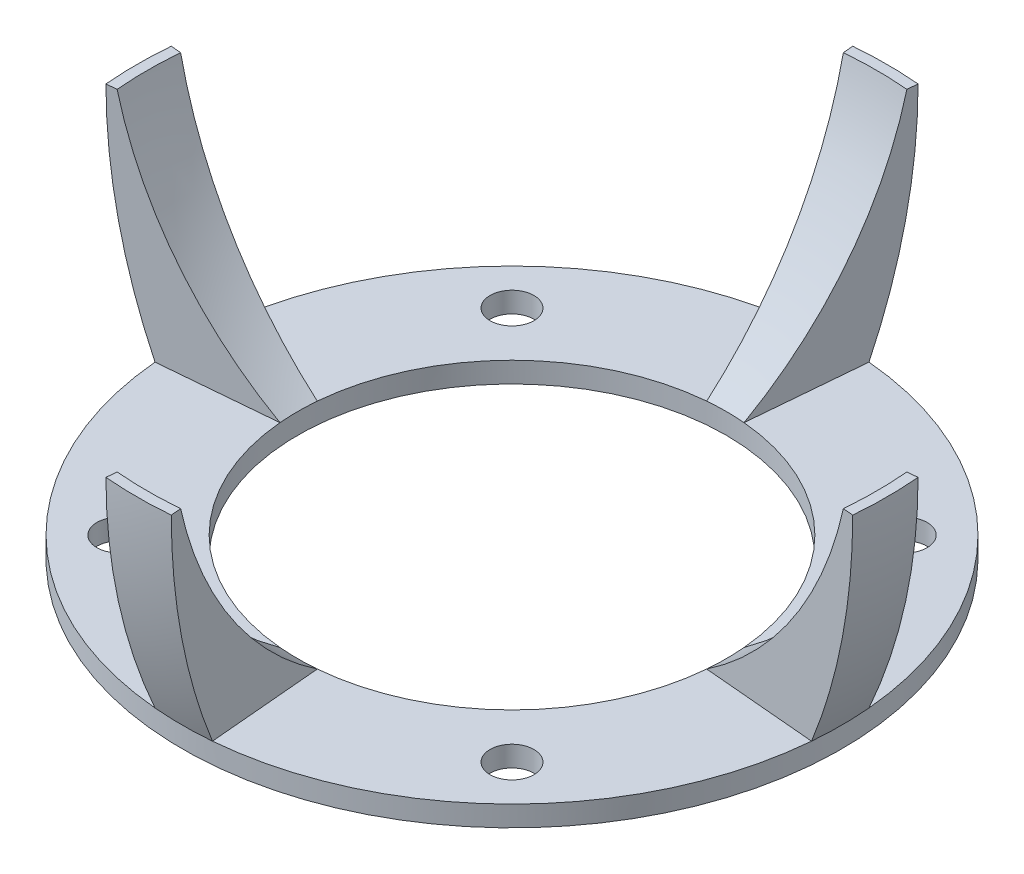
ISO-10303-21;
HEADER;
FILE_DESCRIPTION(('STEP AP214'),'2;1');
FILE_NAME('part.step','',(''),(''),'','','');
FILE_SCHEMA(('AUTOMOTIVE_DESIGN { 1 0 10303 214 1 1 1 1 }'));
ENDSEC;
DATA;
#1=APPLICATION_CONTEXT('core data for automotive mechanical design processes');
#2=APPLICATION_PROTOCOL_DEFINITION('international standard','automotive_design',2000,#1);
#3=PRODUCT_CONTEXT('',#1,'mechanical');
#4=PRODUCT('Part','Part','',(#3));
#5=PRODUCT_RELATED_PRODUCT_CATEGORY('part','',(#4));
#6=PRODUCT_DEFINITION_FORMATION('','',#4);
#7=PRODUCT_DEFINITION_CONTEXT('part definition',#1,'design');
#8=PRODUCT_DEFINITION('design','',#6,#7);
#9=PRODUCT_DEFINITION_SHAPE('','',#8);
#10=(LENGTH_UNIT() NAMED_UNIT(*) SI_UNIT(.MILLI.,.METRE.));
#11=(NAMED_UNIT(*) PLANE_ANGLE_UNIT() SI_UNIT($,.RADIAN.));
#12=(NAMED_UNIT(*) SI_UNIT($,.STERADIAN.) SOLID_ANGLE_UNIT());
#13=UNCERTAINTY_MEASURE_WITH_UNIT(LENGTH_MEASURE(1.E-05),#10,'distance_accuracy_value','');
#14=(GEOMETRIC_REPRESENTATION_CONTEXT(3) GLOBAL_UNCERTAINTY_ASSIGNED_CONTEXT((#13)) GLOBAL_UNIT_ASSIGNED_CONTEXT((#10,
#11,#12)) REPRESENTATION_CONTEXT('',''));
#15=CARTESIAN_POINT('',(0.,0.,0.));
#16=DIRECTION('',(0.,0.,1.));
#17=DIRECTION('',(1.,0.,0.));
#18=AXIS2_PLACEMENT_3D('',#15,#16,#17);
#19=CARTESIAN_POINT('',(-50.8,3.175,0.));
#20=DIRECTION('',(0.,-1.,0.));
#21=DIRECTION('',(0.,0.,-1.));
#22=AXIS2_PLACEMENT_3D('',#19,#20,#21);
#23=PLANE('',#22);
#24=CARTESIAN_POINT('',(-30.3083644086088,3.175,-30.308364408608));
#25=DIRECTION('',(0.,1.,0.));
#26=DIRECTION('',(-1.,0.,0.));
#27=AXIS2_PLACEMENT_3D('',#24,#25,#26);
#28=CIRCLE('',#27,3.3782);
#29=CARTESIAN_POINT('',(-33.6865644086088,3.175,-30.308364408608));
#30=VERTEX_POINT('',#29);
#31=EDGE_CURVE('E409',#30,#30,#28,.T.);
#32=ORIENTED_EDGE('',*,*,#31,.F.);
#33=EDGE_LOOP('',(#32));
#34=FACE_BOUND('',#33,.T.);
#35=DIRECTION('',(0.0871557427476688,0.,0.996194698091745));
#36=VECTOR('',#35,1.);
#37=CARTESIAN_POINT('',(-2.87788262552802,3.175,-32.8943489309894));
#38=LINE('',#37,#36);
#39=CARTESIAN_POINT('',(-4.42751173158157,3.175,-50.6066906630606));
#40=VERTEX_POINT('',#39);
#41=CARTESIAN_POINT('',(-2.87788262552802,3.175,-32.8943489309894));
#42=VERTEX_POINT('',#41);
#43=EDGE_CURVE('E310',#40,#42,#38,.T.);
#44=ORIENTED_EDGE('',*,*,#43,.F.);
#45=CARTESIAN_POINT('',(0.,3.175,0.));
#46=DIRECTION('',(0.,-1.,0.));
#47=DIRECTION('',(0.,0.,-1.));
#48=AXIS2_PLACEMENT_3D('',#45,#46,#47);
#49=CIRCLE('',#48,50.8);
#50=CARTESIAN_POINT('',(-50.6066906630607,3.175,-4.42751173158104));
#51=VERTEX_POINT('',#50);
#52=EDGE_CURVE('E204',#51,#40,#49,.T.);
#53=ORIENTED_EDGE('',*,*,#52,.F.);
#54=DIRECTION('',(0.996194698091746,0.,0.0871557427476584));
#55=VECTOR('',#54,1.);
#56=CARTESIAN_POINT('',(-32.8943489309894,3.175,-2.87788262552768));
#57=LINE('',#56,#55);
#58=CARTESIAN_POINT('',(-32.8943489309894,3.175,-2.87788262552768));
#59=VERTEX_POINT('',#58);
#60=EDGE_CURVE('E273',#51,#59,#57,.T.);
#61=ORIENTED_EDGE('',*,*,#60,.T.);
#62=CARTESIAN_POINT('',(0.,3.175,0.));
#63=DIRECTION('',(0.,-1.,0.));
#64=DIRECTION('',(0.,0.,-1.));
#65=AXIS2_PLACEMENT_3D('',#62,#63,#64);
#66=CIRCLE('',#65,33.02);
#67=EDGE_CURVE('E190',#59,#42,#66,.T.);
#68=ORIENTED_EDGE('',*,*,#67,.T.);
#69=EDGE_LOOP('',(#44,#53,#61,#68));
#70=FACE_BOUND('',#69,.T.);
#71=ADVANCED_FACE('F36',(#34,#70),#23,.F.);
#72=CARTESIAN_POINT('',(30.3083644086083,3.175,-30.3083644086085));
#73=DIRECTION('',(0.,1.,0.));
#74=DIRECTION('',(0.,0.,-1.));
#75=AXIS2_PLACEMENT_3D('',#72,#73,#74);
#76=CIRCLE('',#75,3.3782);
#77=CARTESIAN_POINT('',(30.3083644086083,3.175,-33.6865644086085));
#78=VERTEX_POINT('',#77);
#79=EDGE_CURVE('E403',#78,#78,#76,.T.);
#80=ORIENTED_EDGE('',*,*,#79,.F.);
#81=EDGE_LOOP('',(#80));
#82=FACE_BOUND('',#81,.T.);
#83=CARTESIAN_POINT('',(4.42751173158051,3.175,-50.6066906630607));
#84=VERTEX_POINT('',#83);
#85=CARTESIAN_POINT('',(50.6066906630607,3.175,-4.42751173158104));
#86=VERTEX_POINT('',#85);
#87=EDGE_CURVE('E180',#84,#86,#49,.T.);
#88=ORIENTED_EDGE('',*,*,#87,.F.);
#89=DIRECTION('',(-0.0871557427476479,0.,0.996194698091746));
#90=VECTOR('',#89,1.);
#91=CARTESIAN_POINT('',(2.87788262552734,3.175,-32.8943489309895));
#92=LINE('',#91,#90);
#93=CARTESIAN_POINT('',(2.87788262552734,3.175,-32.8943489309895));
#94=VERTEX_POINT('',#93);
#95=EDGE_CURVE('E154',#84,#94,#92,.T.);
#96=ORIENTED_EDGE('',*,*,#95,.T.);
#97=CARTESIAN_POINT('',(32.8943489309894,3.175,-2.87788262552768));
#98=VERTEX_POINT('',#97);
#99=EDGE_CURVE('E178',#94,#98,#66,.T.);
#100=ORIENTED_EDGE('',*,*,#99,.T.);
#101=DIRECTION('',(-0.996194698091746,0.,0.0871557427476583));
#102=VECTOR('',#101,1.);
#103=CARTESIAN_POINT('',(32.8943489309894,3.175,-2.87788262552768));
#104=LINE('',#103,#102);
#105=EDGE_CURVE('E222',#86,#98,#104,.T.);
#106=ORIENTED_EDGE('',*,*,#105,.F.);
#107=EDGE_LOOP('',(#88,#96,#100,#106));
#108=FACE_BOUND('',#107,.T.);
#109=ADVANCED_FACE('F176',(#82,#108),#23,.F.);
#110=CARTESIAN_POINT('',(30.3083644086086,3.175,30.3083644086082));
#111=DIRECTION('',(0.,1.,0.));
#112=DIRECTION('',(1.,0.,0.));
#113=AXIS2_PLACEMENT_3D('',#110,#111,#112);
#114=CIRCLE('',#113,3.3782);
#115=CARTESIAN_POINT('',(33.6865644086086,3.175,30.3083644086082));
#116=VERTEX_POINT('',#115);
#117=EDGE_CURVE('E395',#116,#116,#114,.T.);
#118=ORIENTED_EDGE('',*,*,#117,.F.);
#119=EDGE_LOOP('',(#118));
#120=FACE_BOUND('',#119,.T.);
#121=CARTESIAN_POINT('',(50.6066906630607,3.175,4.42751173158104));
#122=VERTEX_POINT('',#121);
#123=CARTESIAN_POINT('',(4.42751173158122,3.175,50.6066906630607));
#124=VERTEX_POINT('',#123);
#125=EDGE_CURVE('E203',#122,#124,#49,.T.);
#126=ORIENTED_EDGE('',*,*,#125,.F.);
#127=DIRECTION('',(-0.996194698091746,0.,-0.0871557427476584));
#128=VECTOR('',#127,1.);
#129=CARTESIAN_POINT('',(32.8943489309894,3.175,2.87788262552768));
#130=LINE('',#129,#128);
#131=CARTESIAN_POINT('',(32.8943489309894,3.175,2.87788262552768));
#132=VERTEX_POINT('',#131);
#133=EDGE_CURVE('E172',#122,#132,#130,.T.);
#134=ORIENTED_EDGE('',*,*,#133,.T.);
#135=CARTESIAN_POINT('',(2.87788262552779,3.175,32.8943489309894));
#136=VERTEX_POINT('',#135);
#137=EDGE_CURVE('E191',#132,#136,#66,.T.);
#138=ORIENTED_EDGE('',*,*,#137,.T.);
#139=DIRECTION('',(-0.0871557427476618,0.,-0.996194698091745));
#140=VECTOR('',#139,1.);
#141=CARTESIAN_POINT('',(2.87788262552779,3.175,32.8943489309894));
#142=LINE('',#141,#140);
#143=EDGE_CURVE('E258',#124,#136,#142,.T.);
#144=ORIENTED_EDGE('',*,*,#143,.F.);
#145=EDGE_LOOP('',(#126,#134,#138,#144));
#146=FACE_BOUND('',#145,.T.);
#147=ADVANCED_FACE('F342',(#120,#146),#23,.F.);
#148=CARTESIAN_POINT('',(0.,-0.158750000000002,0.));
#149=DIRECTION('',(0.,-1.,0.));
#150=DIRECTION('',(0.,0.,-1.));
#151=AXIS2_PLACEMENT_3D('',#148,#149,#150);
#152=CYLINDRICAL_SURFACE('',#151,33.02);
#153=CARTESIAN_POINT('',(-32.8943489309894,3.175,2.87788262552768));
#154=VERTEX_POINT('',#153);
#155=EDGE_CURVE('E193',#154,#59,#66,.T.);
#156=ORIENTED_EDGE('',*,*,#155,.F.);
#157=CARTESIAN_POINT('',(-2.87788262552758,3.175,32.8943489309895));
#158=VERTEX_POINT('',#157);
#159=EDGE_CURVE('E194',#158,#154,#66,.T.);
#160=ORIENTED_EDGE('',*,*,#159,.F.);
#161=CARTESIAN_POINT('',(0.,3.175,0.));
#162=DIRECTION('',(0.,-1.,0.));
#163=DIRECTION('',(-1.,0.,0.));
#164=AXIS2_PLACEMENT_3D('',#161,#162,#163);
#165=CIRCLE('',#164,33.02);
#166=EDGE_CURVE('E263',#136,#158,#165,.T.);
#167=ORIENTED_EDGE('',*,*,#166,.F.);
#168=ORIENTED_EDGE('',*,*,#137,.F.);
#169=CARTESIAN_POINT('',(0.,3.175,0.));
#170=DIRECTION('',(0.,-1.,0.));
#171=DIRECTION('',(0.,0.,1.));
#172=AXIS2_PLACEMENT_3D('',#169,#170,#171);
#173=CIRCLE('',#172,33.02);
#174=EDGE_CURVE('E189',#98,#132,#173,.T.);
#175=ORIENTED_EDGE('',*,*,#174,.F.);
#176=ORIENTED_EDGE('',*,*,#99,.F.);
#177=CARTESIAN_POINT('',(0.,3.175,0.));
#178=DIRECTION('',(0.,-1.,0.));
#179=DIRECTION('',(1.,0.,0.));
#180=AXIS2_PLACEMENT_3D('',#177,#178,#179);
#181=CIRCLE('',#180,33.02);
#182=EDGE_CURVE('E163',#42,#94,#181,.T.);
#183=ORIENTED_EDGE('',*,*,#182,.F.);
#184=ORIENTED_EDGE('',*,*,#67,.F.);
#185=EDGE_LOOP('',(#156,#160,#167,#168,#175,#176,#183,#184));
#186=FACE_BOUND('',#185,.T.);
#187=CARTESIAN_POINT('',(0.,0.,0.));
#188=DIRECTION('',(0.,-1.,0.));
#189=DIRECTION('',(0.,0.,-1.));
#190=AXIS2_PLACEMENT_3D('',#187,#188,#189);
#191=CIRCLE('',#190,33.02);
#192=CARTESIAN_POINT('',(0.,0.,-33.02));
#193=VERTEX_POINT('',#192);
#194=EDGE_CURVE('E11',#193,#193,#191,.T.);
#195=ORIENTED_EDGE('',*,*,#194,.T.);
#196=EDGE_LOOP('',(#195));
#197=FACE_BOUND('',#196,.T.);
#198=ADVANCED_FACE('F38',(#186,#197),#152,.F.);
#199=CARTESIAN_POINT('',(-33.02,0.,0.));
#200=DIRECTION('',(0.,1.,0.));
#201=DIRECTION('',(0.,0.,1.));
#202=AXIS2_PLACEMENT_3D('',#199,#200,#201);
#203=PLANE('',#202);
#204=CARTESIAN_POINT('',(30.3083644086086,0.,30.3083644086082));
#205=DIRECTION('',(0.,1.,0.));
#206=DIRECTION('',(1.,0.,0.));
#207=AXIS2_PLACEMENT_3D('',#204,#205,#206);
#208=CIRCLE('',#207,3.3782);
#209=CARTESIAN_POINT('',(33.6865644086086,0.,30.3083644086082));
#210=VERTEX_POINT('',#209);
#211=EDGE_CURVE('E398',#210,#210,#208,.T.);
#212=ORIENTED_EDGE('',*,*,#211,.T.);
#213=EDGE_LOOP('',(#212));
#214=FACE_BOUND('',#213,.T.);
#215=CARTESIAN_POINT('',(30.3083644086083,0.,-30.3083644086085));
#216=DIRECTION('',(0.,1.,0.));
#217=DIRECTION('',(0.,0.,-1.));
#218=AXIS2_PLACEMENT_3D('',#215,#216,#217);
#219=CIRCLE('',#218,3.3782);
#220=CARTESIAN_POINT('',(30.3083644086083,0.,-33.6865644086085));
#221=VERTEX_POINT('',#220);
#222=EDGE_CURVE('E406',#221,#221,#219,.T.);
#223=ORIENTED_EDGE('',*,*,#222,.T.);
#224=EDGE_LOOP('',(#223));
#225=FACE_BOUND('',#224,.T.);
#226=CARTESIAN_POINT('',(-30.3083644086088,0.,-30.308364408608));
#227=DIRECTION('',(0.,1.,0.));
#228=DIRECTION('',(-1.,0.,0.));
#229=AXIS2_PLACEMENT_3D('',#226,#227,#228);
#230=CIRCLE('',#229,3.3782);
#231=CARTESIAN_POINT('',(-33.6865644086088,0.,-30.308364408608));
#232=VERTEX_POINT('',#231);
#233=EDGE_CURVE('E412',#232,#232,#230,.T.);
#234=ORIENTED_EDGE('',*,*,#233,.T.);
#235=EDGE_LOOP('',(#234));
#236=FACE_BOUND('',#235,.T.);
#237=CARTESIAN_POINT('',(-30.3083644086083,0.,30.3083644086085));
#238=DIRECTION('',(0.,1.,0.));
#239=DIRECTION('',(0.,0.,1.));
#240=AXIS2_PLACEMENT_3D('',#237,#238,#239);
#241=CIRCLE('',#240,3.3782);
#242=CARTESIAN_POINT('',(-30.3083644086083,0.,33.6865644086085));
#243=VERTEX_POINT('',#242);
#244=EDGE_CURVE('E182',#243,#243,#241,.T.);
#245=ORIENTED_EDGE('',*,*,#244,.T.);
#246=EDGE_LOOP('',(#245));
#247=FACE_BOUND('',#246,.T.);
#248=ORIENTED_EDGE('',*,*,#194,.F.);
#249=EDGE_LOOP('',(#248));
#250=FACE_BOUND('',#249,.T.);
#251=CARTESIAN_POINT('',(0.,0.,0.));
#252=DIRECTION('',(0.,-1.,0.));
#253=DIRECTION('',(0.,0.,-1.));
#254=AXIS2_PLACEMENT_3D('',#251,#252,#253);
#255=CIRCLE('',#254,50.8);
#256=CARTESIAN_POINT('',(0.,0.,-50.8));
#257=VERTEX_POINT('',#256);
#258=EDGE_CURVE('E44',#257,#257,#255,.T.);
#259=ORIENTED_EDGE('',*,*,#258,.T.);
#260=EDGE_LOOP('',(#259));
#261=FACE_BOUND('',#260,.T.);
#262=ADVANCED_FACE('F385',(#214,#225,#236,#247,#250,#261),#203,.F.);
#263=CARTESIAN_POINT('',(0.,-0.158750000000002,0.));
#264=DIRECTION('',(0.,-1.,0.));
#265=DIRECTION('',(0.,0.,-1.));
#266=AXIS2_PLACEMENT_3D('',#263,#264,#265);
#267=CYLINDRICAL_SURFACE('',#266,50.8);
#268=ORIENTED_EDGE('',*,*,#258,.F.);
#269=EDGE_LOOP('',(#268));
#270=FACE_BOUND('',#269,.T.);
#271=CARTESIAN_POINT('',(-50.6066906630607,3.175,4.42751173158104));
#272=VERTEX_POINT('',#271);
#273=EDGE_CURVE('E210',#272,#51,#49,.T.);
#274=ORIENTED_EDGE('',*,*,#273,.T.);
#275=ORIENTED_EDGE('',*,*,#52,.T.);
#276=CARTESIAN_POINT('',(0.,3.175,0.));
#277=DIRECTION('',(0.,-1.,0.));
#278=DIRECTION('',(1.,0.,0.));
#279=AXIS2_PLACEMENT_3D('',#276,#277,#278);
#280=CIRCLE('',#279,50.8);
#281=EDGE_CURVE('E173',#40,#84,#280,.T.);
#282=ORIENTED_EDGE('',*,*,#281,.T.);
#283=ORIENTED_EDGE('',*,*,#87,.T.);
#284=CARTESIAN_POINT('',(0.,3.175,0.));
#285=DIRECTION('',(0.,-1.,0.));
#286=DIRECTION('',(0.,0.,1.));
#287=AXIS2_PLACEMENT_3D('',#284,#285,#286);
#288=CIRCLE('',#287,50.8);
#289=EDGE_CURVE('E215',#86,#122,#288,.T.);
#290=ORIENTED_EDGE('',*,*,#289,.T.);
#291=ORIENTED_EDGE('',*,*,#125,.T.);
#292=CARTESIAN_POINT('',(0.,3.175,0.));
#293=DIRECTION('',(0.,-1.,0.));
#294=DIRECTION('',(-1.,0.,0.));
#295=AXIS2_PLACEMENT_3D('',#292,#293,#294);
#296=CIRCLE('',#295,50.8);
#297=CARTESIAN_POINT('',(-4.42751173158087,3.175,50.6066906630607));
#298=VERTEX_POINT('',#297);
#299=EDGE_CURVE('E261',#124,#298,#296,.T.);
#300=ORIENTED_EDGE('',*,*,#299,.T.);
#301=EDGE_CURVE('E198',#298,#272,#49,.T.);
#302=ORIENTED_EDGE('',*,*,#301,.T.);
#303=EDGE_LOOP('',(#274,#275,#282,#283,#290,#291,#300,#302));
#304=FACE_BOUND('',#303,.T.);
#305=ADVANCED_FACE('F214',(#270,#304),#267,.T.);
#306=CARTESIAN_POINT('',(-30.3083644086083,3.175,30.3083644086085));
#307=DIRECTION('',(0.,1.,0.));
#308=DIRECTION('',(0.,0.,1.));
#309=AXIS2_PLACEMENT_3D('',#306,#307,#308);
#310=CIRCLE('',#309,3.3782);
#311=CARTESIAN_POINT('',(-30.3083644086083,3.175,33.6865644086085));
#312=VERTEX_POINT('',#311);
#313=EDGE_CURVE('E397',#312,#312,#310,.T.);
#314=ORIENTED_EDGE('',*,*,#313,.F.);
#315=EDGE_LOOP('',(#314));
#316=FACE_BOUND('',#315,.T.);
#317=ORIENTED_EDGE('',*,*,#301,.F.);
#318=DIRECTION('',(0.0871557427476549,0.,-0.996194698091746));
#319=VECTOR('',#318,1.);
#320=CARTESIAN_POINT('',(-2.87788262552756,3.175,32.8943489309895));
#321=LINE('',#320,#319);
#322=EDGE_CURVE('E233',#298,#158,#321,.T.);
#323=ORIENTED_EDGE('',*,*,#322,.T.);
#324=ORIENTED_EDGE('',*,*,#159,.T.);
#325=DIRECTION('',(0.996194698091746,0.,-0.0871557427476583));
#326=VECTOR('',#325,1.);
#327=CARTESIAN_POINT('',(-32.8943489309894,3.175,2.87788262552768));
#328=LINE('',#327,#326);
#329=EDGE_CURVE('E284',#272,#154,#328,.T.);
#330=ORIENTED_EDGE('',*,*,#329,.F.);
#331=EDGE_LOOP('',(#317,#323,#324,#330));
#332=FACE_BOUND('',#331,.T.);
#333=ADVANCED_FACE('F293',(#316,#332),#23,.F.);
#334=CARTESIAN_POINT('',(0.,50.5963646471714,0.));
#335=DIRECTION('',(0.,-1.,0.));
#336=DIRECTION('',(-0.996194698091746,0.,0.0871557427476583));
#337=AXIS2_PLACEMENT_3D('',#334,#335,#336);
#338=SPHERICAL_SURFACE('',#337,57.785);
#339=ORIENTED_EDGE('',*,*,#155,.T.);
#340=CARTESIAN_POINT('',(0.,50.5963646471714,0.));
#341=DIRECTION('',(0.0871557427476584,0.,-0.996194698091746));
#342=DIRECTION('',(-0.996194698091746,0.,-0.0871557427476584));
#343=AXIS2_PLACEMENT_3D('',#340,#341,#342);
#344=CIRCLE('',#343,57.785);
#345=CARTESIAN_POINT('',(-55.9836515460109,37.1447023428315,-4.89793485306153));
#346=VERTEX_POINT('',#345);
#347=EDGE_CURVE('E265',#59,#346,#344,.T.);
#348=ORIENTED_EDGE('',*,*,#347,.T.);
#349=CARTESIAN_POINT('',(0.,37.1447023428315,0.));
#350=DIRECTION('',(0.,-1.,0.));
#351=DIRECTION('',(0.,0.,-1.));
#352=AXIS2_PLACEMENT_3D('',#349,#350,#351);
#353=CIRCLE('',#352,56.1975);
#354=CARTESIAN_POINT('',(-55.9836515460109,37.1447023428315,4.89793485306153));
#355=VERTEX_POINT('',#354);
#356=EDGE_CURVE('E287',#355,#346,#353,.T.);
#357=ORIENTED_EDGE('',*,*,#356,.F.);
#358=CARTESIAN_POINT('',(0.,50.5963646471714,0.));
#359=DIRECTION('',(-0.0871557427476583,0.,-0.996194698091746));
#360=DIRECTION('',(-0.996194698091746,0.,0.0871557427476583));
#361=AXIS2_PLACEMENT_3D('',#358,#359,#360);
#362=CIRCLE('',#361,57.785);
#363=EDGE_CURVE('E275',#154,#355,#362,.T.);
#364=ORIENTED_EDGE('',*,*,#363,.F.);
#365=EDGE_LOOP('',(#339,#348,#357,#364));
#366=FACE_BOUND('',#365,.T.);
#367=ADVANCED_FACE('F298',(#366),#338,.F.);
#368=CARTESIAN_POINT('',(0.,37.1447023428315,0.));
#369=DIRECTION('',(0.,-1.,0.));
#370=DIRECTION('',(0.,0.,-1.));
#371=AXIS2_PLACEMENT_3D('',#368,#369,#370);
#372=DEGENERATE_TOROIDAL_SURFACE('',#371,28.3088369549442,86.0938369549442,.F.);
#373=CARTESIAN_POINT('',(0.,37.1447023428315,0.));
#374=DIRECTION('',(0.,-1.,0.));
#375=DIRECTION('',(0.,0.,-1.));
#376=AXIS2_PLACEMENT_3D('',#373,#374,#375);
#377=CIRCLE('',#376,57.785);
#378=CARTESIAN_POINT('',(-57.5651106292315,37.1447023428315,5.03629459467344));
#379=VERTEX_POINT('',#378);
#380=CARTESIAN_POINT('',(-57.5651106292315,37.1447023428315,-5.03629459467344));
#381=VERTEX_POINT('',#380);
#382=EDGE_CURVE('E288',#379,#381,#377,.T.);
#383=ORIENTED_EDGE('',*,*,#382,.T.);
#384=CARTESIAN_POINT('',(28.2011132836591,37.1447023428315,2.46727771113052));
#385=DIRECTION('',(-0.0871557427476584,0.,0.996194698091746));
#386=DIRECTION('',(-0.996194698091746,0.,-0.0871557427476584));
#387=AXIS2_PLACEMENT_3D('',#384,#385,#386);
#388=CIRCLE('',#387,86.0938369549442);
#389=EDGE_CURVE('E270',#381,#51,#388,.T.);
#390=ORIENTED_EDGE('',*,*,#389,.T.);
#391=ORIENTED_EDGE('',*,*,#273,.F.);
#392=CARTESIAN_POINT('',(28.2011132836591,37.1447023428315,-2.46727771113052));
#393=DIRECTION('',(0.0871557427476583,0.,0.996194698091746));
#394=DIRECTION('',(-0.996194698091746,0.,0.0871557427476583));
#395=AXIS2_PLACEMENT_3D('',#392,#393,#394);
#396=CIRCLE('',#395,86.0938369549442);
#397=EDGE_CURVE('E281',#379,#272,#396,.T.);
#398=ORIENTED_EDGE('',*,*,#397,.F.);
#399=EDGE_LOOP('',(#383,#390,#391,#398));
#400=FACE_BOUND('',#399,.T.);
#401=ADVANCED_FACE('F303',(#400),#372,.F.);
#402=CARTESIAN_POINT('',(-55.9836515460109,37.1447023428315,4.89793485306153));
#403=DIRECTION('',(0.,-1.,0.));
#404=DIRECTION('',(0.,0.,-1.));
#405=AXIS2_PLACEMENT_3D('',#402,#403,#404);
#406=PLANE('',#405);
#407=DIRECTION('',(-0.996194698091746,0.,0.0871557427476583));
#408=VECTOR('',#407,1.);
#409=CARTESIAN_POINT('',(-55.9836515460109,37.1447023428315,4.89793485306153));
#410=LINE('',#409,#408);
#411=EDGE_CURVE('E278',#355,#379,#410,.T.);
#412=ORIENTED_EDGE('',*,*,#411,.F.);
#413=ORIENTED_EDGE('',*,*,#356,.T.);
#414=DIRECTION('',(-0.996194698091746,0.,-0.0871557427476584));
#415=VECTOR('',#414,1.);
#416=CARTESIAN_POINT('',(-55.9836515460109,37.1447023428315,-4.89793485306153));
#417=LINE('',#416,#415);
#418=EDGE_CURVE('E267',#346,#381,#417,.T.);
#419=ORIENTED_EDGE('',*,*,#418,.T.);
#420=ORIENTED_EDGE('',*,*,#382,.F.);
#421=EDGE_LOOP('',(#412,#413,#419,#420));
#422=FACE_BOUND('',#421,.T.);
#423=ADVANCED_FACE('F302',(#422),#406,.F.);
#424=CARTESIAN_POINT('',(0.,50.5963646471714,0.));
#425=DIRECTION('',(-0.0871557427476583,0.,-0.996194698091746));
#426=DIRECTION('',(-0.996194698091746,0.,0.0871557427476583));
#427=AXIS2_PLACEMENT_3D('',#424,#425,#426);
#428=PLANE('',#427);
#429=ORIENTED_EDGE('',*,*,#363,.T.);
#430=ORIENTED_EDGE('',*,*,#411,.T.);
#431=ORIENTED_EDGE('',*,*,#397,.T.);
#432=ORIENTED_EDGE('',*,*,#329,.T.);
#433=EDGE_LOOP('',(#429,#430,#431,#432));
#434=FACE_BOUND('',#433,.T.);
#435=ADVANCED_FACE('F297',(#434),#428,.F.);
#436=CARTESIAN_POINT('',(0.,50.5963646471714,0.));
#437=DIRECTION('',(0.0871557427476584,0.,-0.996194698091746));
#438=DIRECTION('',(-0.996194698091746,0.,-0.0871557427476584));
#439=AXIS2_PLACEMENT_3D('',#436,#437,#438);
#440=PLANE('',#439);
#441=ORIENTED_EDGE('',*,*,#347,.F.);
#442=ORIENTED_EDGE('',*,*,#60,.F.);
#443=ORIENTED_EDGE('',*,*,#389,.F.);
#444=ORIENTED_EDGE('',*,*,#418,.F.);
#445=EDGE_LOOP('',(#441,#442,#443,#444));
#446=FACE_BOUND('',#445,.T.);
#447=ADVANCED_FACE('F307',(#446),#440,.T.);
#448=CARTESIAN_POINT('',(0.,50.5963646471714,0.));
#449=DIRECTION('',(0.,-1.,0.));
#450=DIRECTION('',(0.0871557427476618,0.,0.996194698091745));
#451=AXIS2_PLACEMENT_3D('',#448,#449,#450);
#452=SPHERICAL_SURFACE('',#451,57.785);
#453=ORIENTED_EDGE('',*,*,#166,.T.);
#454=CARTESIAN_POINT('',(0.,50.5963646471714,0.));
#455=DIRECTION('',(-0.996194698091746,0.,-0.0871557427476549));
#456=DIRECTION('',(-0.0871557427476549,0.,0.996194698091746));
#457=AXIS2_PLACEMENT_3D('',#454,#455,#456);
#458=CIRCLE('',#457,57.785);
#459=CARTESIAN_POINT('',(-4.89793485306133,37.1447023428315,55.9836515460109));
#460=VERTEX_POINT('',#459);
#461=EDGE_CURVE('E236',#158,#460,#458,.T.);
#462=ORIENTED_EDGE('',*,*,#461,.T.);
#463=CARTESIAN_POINT('',(0.,37.1447023428315,0.));
#464=DIRECTION('',(0.,-1.,0.));
#465=DIRECTION('',(-1.,0.,0.));
#466=AXIS2_PLACEMENT_3D('',#463,#464,#465);
#467=CIRCLE('',#466,56.1975);
#468=CARTESIAN_POINT('',(4.89793485306173,37.1447023428315,55.9836515460108));
#469=VERTEX_POINT('',#468);
#470=EDGE_CURVE('E246',#469,#460,#467,.T.);
#471=ORIENTED_EDGE('',*,*,#470,.F.);
#472=CARTESIAN_POINT('',(0.,50.5963646471714,0.));
#473=DIRECTION('',(-0.996194698091745,0.,0.0871557427476618));
#474=DIRECTION('',(0.0871557427476618,0.,0.996194698091745));
#475=AXIS2_PLACEMENT_3D('',#472,#473,#474);
#476=CIRCLE('',#475,57.785);
#477=EDGE_CURVE('E252',#136,#469,#476,.T.);
#478=ORIENTED_EDGE('',*,*,#477,.F.);
#479=EDGE_LOOP('',(#453,#462,#471,#478));
#480=FACE_BOUND('',#479,.T.);
#481=ADVANCED_FACE('F359',(#480),#452,.F.);
#482=CARTESIAN_POINT('',(0.,37.1447023428315,0.));
#483=DIRECTION('',(0.,-1.,0.));
#484=DIRECTION('',(-1.,0.,0.));
#485=AXIS2_PLACEMENT_3D('',#482,#483,#484);
#486=DEGENERATE_TOROIDAL_SURFACE('',#485,28.3088369549442,86.0938369549442,.F.);
#487=CARTESIAN_POINT('',(0.,37.1447023428315,0.));
#488=DIRECTION('',(0.,-1.,0.));
#489=DIRECTION('',(-1.,0.,0.));
#490=AXIS2_PLACEMENT_3D('',#487,#488,#489);
#491=CIRCLE('',#490,57.785);
#492=CARTESIAN_POINT('',(5.03629459467364,37.1447023428315,57.5651106292315));
#493=VERTEX_POINT('',#492);
#494=CARTESIAN_POINT('',(-5.03629459467324,37.1447023428315,57.5651106292315));
#495=VERTEX_POINT('',#494);
#496=EDGE_CURVE('E249',#493,#495,#491,.T.);
#497=ORIENTED_EDGE('',*,*,#496,.T.);
#498=CARTESIAN_POINT('',(2.46727771113042,37.1447023428315,-28.2011132836591));
#499=DIRECTION('',(0.996194698091746,0.,0.0871557427476549));
#500=DIRECTION('',(-0.0871557427476549,0.,0.996194698091746));
#501=AXIS2_PLACEMENT_3D('',#498,#499,#500);
#502=CIRCLE('',#501,86.0938369549442);
#503=EDGE_CURVE('E238',#495,#298,#502,.T.);
#504=ORIENTED_EDGE('',*,*,#503,.T.);
#505=ORIENTED_EDGE('',*,*,#299,.F.);
#506=CARTESIAN_POINT('',(-2.46727771113062,37.1447023428315,-28.2011132836591));
#507=DIRECTION('',(0.996194698091745,0.,-0.0871557427476618));
#508=DIRECTION('',(0.0871557427476618,0.,0.996194698091745));
#509=AXIS2_PLACEMENT_3D('',#506,#507,#508);
#510=CIRCLE('',#509,86.0938369549442);
#511=EDGE_CURVE('E255',#493,#124,#510,.T.);
#512=ORIENTED_EDGE('',*,*,#511,.F.);
#513=EDGE_LOOP('',(#497,#504,#505,#512));
#514=FACE_BOUND('',#513,.T.);
#515=ADVANCED_FACE('F349',(#514),#486,.F.);
#516=CARTESIAN_POINT('',(0.,50.5963646471714,0.));
#517=DIRECTION('',(-0.996194698091745,0.,0.0871557427476618));
#518=DIRECTION('',(0.0871557427476618,0.,0.996194698091745));
#519=AXIS2_PLACEMENT_3D('',#516,#517,#518);
#520=PLANE('',#519);
#521=ORIENTED_EDGE('',*,*,#477,.T.);
#522=DIRECTION('',(0.0871557427476618,0.,0.996194698091745));
#523=VECTOR('',#522,1.);
#524=CARTESIAN_POINT('',(4.89793485306173,37.1447023428315,55.9836515460108));
#525=LINE('',#524,#523);
#526=EDGE_CURVE('E244',#469,#493,#525,.T.);
#527=ORIENTED_EDGE('',*,*,#526,.T.);
#528=ORIENTED_EDGE('',*,*,#511,.T.);
#529=ORIENTED_EDGE('',*,*,#143,.T.);
#530=EDGE_LOOP('',(#521,#527,#528,#529));
#531=FACE_BOUND('',#530,.T.);
#532=ADVANCED_FACE('F346',(#531),#520,.F.);
#533=CARTESIAN_POINT('',(4.89793485306173,37.1447023428315,55.9836515460108));
#534=DIRECTION('',(0.,-1.,0.));
#535=DIRECTION('',(-1.,0.,0.));
#536=AXIS2_PLACEMENT_3D('',#533,#534,#535);
#537=PLANE('',#536);
#538=ORIENTED_EDGE('',*,*,#526,.F.);
#539=ORIENTED_EDGE('',*,*,#470,.T.);
#540=DIRECTION('',(-0.0871557427476549,0.,0.996194698091746));
#541=VECTOR('',#540,1.);
#542=CARTESIAN_POINT('',(-4.89793485306133,37.1447023428315,55.9836515460109));
#543=LINE('',#542,#541);
#544=EDGE_CURVE('E241',#460,#495,#543,.T.);
#545=ORIENTED_EDGE('',*,*,#544,.T.);
#546=ORIENTED_EDGE('',*,*,#496,.F.);
#547=EDGE_LOOP('',(#538,#539,#545,#546));
#548=FACE_BOUND('',#547,.T.);
#549=ADVANCED_FACE('F355',(#548),#537,.F.);
#550=CARTESIAN_POINT('',(0.,50.5963646471714,0.));
#551=DIRECTION('',(-0.996194698091746,0.,-0.0871557427476549));
#552=DIRECTION('',(-0.0871557427476549,0.,0.996194698091746));
#553=AXIS2_PLACEMENT_3D('',#550,#551,#552);
#554=PLANE('',#553);
#555=ORIENTED_EDGE('',*,*,#461,.F.);
#556=ORIENTED_EDGE('',*,*,#322,.F.);
#557=ORIENTED_EDGE('',*,*,#503,.F.);
#558=ORIENTED_EDGE('',*,*,#544,.F.);
#559=EDGE_LOOP('',(#555,#556,#557,#558));
#560=FACE_BOUND('',#559,.T.);
#561=ADVANCED_FACE('F353',(#560),#554,.T.);
#562=CARTESIAN_POINT('',(0.,50.5963646471714,0.));
#563=DIRECTION('',(0.,-1.,0.));
#564=DIRECTION('',(0.996194698091746,0.,-0.0871557427476583));
#565=AXIS2_PLACEMENT_3D('',#562,#563,#564);
#566=SPHERICAL_SURFACE('',#565,57.785);
#567=ORIENTED_EDGE('',*,*,#174,.T.);
#568=CARTESIAN_POINT('',(0.,50.5963646471714,0.));
#569=DIRECTION('',(-0.0871557427476584,0.,0.996194698091746));
#570=DIRECTION('',(0.996194698091746,0.,0.0871557427476584));
#571=AXIS2_PLACEMENT_3D('',#568,#569,#570);
#572=CIRCLE('',#571,57.785);
#573=CARTESIAN_POINT('',(55.9836515460109,37.1447023428315,4.89793485306153));
#574=VERTEX_POINT('',#573);
#575=EDGE_CURVE('E320',#132,#574,#572,.T.);
#576=ORIENTED_EDGE('',*,*,#575,.T.);
#577=CARTESIAN_POINT('',(0.,37.1447023428315,0.));
#578=DIRECTION('',(0.,-1.,0.));
#579=DIRECTION('',(0.,0.,1.));
#580=AXIS2_PLACEMENT_3D('',#577,#578,#579);
#581=CIRCLE('',#580,56.1975);
#582=CARTESIAN_POINT('',(55.9836515460109,37.1447023428315,-4.89793485306153));
#583=VERTEX_POINT('',#582);
#584=EDGE_CURVE('E327',#583,#574,#581,.T.);
#585=ORIENTED_EDGE('',*,*,#584,.F.);
#586=CARTESIAN_POINT('',(0.,50.5963646471714,0.));
#587=DIRECTION('',(0.0871557427476583,0.,0.996194698091746));
#588=DIRECTION('',(0.996194698091746,0.,-0.0871557427476583));
#589=AXIS2_PLACEMENT_3D('',#586,#587,#588);
#590=CIRCLE('',#589,57.785);
#591=EDGE_CURVE('E225',#98,#583,#590,.T.);
#592=ORIENTED_EDGE('',*,*,#591,.F.);
#593=EDGE_LOOP('',(#567,#576,#585,#592));
#594=FACE_BOUND('',#593,.T.);
#595=ADVANCED_FACE('F333',(#594),#566,.F.);
#596=CARTESIAN_POINT('',(0.,37.1447023428315,0.));
#597=DIRECTION('',(0.,-1.,0.));
#598=DIRECTION('',(0.,0.,1.));
#599=AXIS2_PLACEMENT_3D('',#596,#597,#598);
#600=DEGENERATE_TOROIDAL_SURFACE('',#599,28.3088369549442,86.0938369549442,.F.);
#601=CARTESIAN_POINT('',(0.,37.1447023428315,0.));
#602=DIRECTION('',(0.,-1.,0.));
#603=DIRECTION('',(0.,0.,1.));
#604=AXIS2_PLACEMENT_3D('',#601,#602,#603);
#605=CIRCLE('',#604,57.785);
#606=CARTESIAN_POINT('',(57.5651106292315,37.1447023428315,-5.03629459467344));
#607=VERTEX_POINT('',#606);
#608=CARTESIAN_POINT('',(57.5651106292315,37.1447023428315,5.03629459467344));
#609=VERTEX_POINT('',#608);
#610=EDGE_CURVE('E330',#607,#609,#605,.T.);
#611=ORIENTED_EDGE('',*,*,#610,.T.);
#612=CARTESIAN_POINT('',(-28.2011132836591,37.1447023428315,-2.46727771113052));
#613=DIRECTION('',(0.0871557427476584,0.,-0.996194698091746));
#614=DIRECTION('',(0.996194698091746,0.,0.0871557427476584));
#615=AXIS2_PLACEMENT_3D('',#612,#613,#614);
#616=CIRCLE('',#615,86.0938369549442);
#617=EDGE_CURVE('E59',#609,#122,#616,.T.);
#618=ORIENTED_EDGE('',*,*,#617,.T.);
#619=ORIENTED_EDGE('',*,*,#289,.F.);
#620=CARTESIAN_POINT('',(-28.2011132836591,37.1447023428315,2.46727771113052));
#621=DIRECTION('',(-0.0871557427476583,0.,-0.996194698091746));
#622=DIRECTION('',(0.996194698091746,0.,-0.0871557427476583));
#623=AXIS2_PLACEMENT_3D('',#620,#621,#622);
#624=CIRCLE('',#623,86.0938369549442);
#625=EDGE_CURVE('E219',#607,#86,#624,.T.);
#626=ORIENTED_EDGE('',*,*,#625,.F.);
#627=EDGE_LOOP('',(#611,#618,#619,#626));
#628=FACE_BOUND('',#627,.T.);
#629=ADVANCED_FACE('F227',(#628),#600,.F.);
#630=CARTESIAN_POINT('',(0.,50.5963646471714,0.));
#631=DIRECTION('',(0.0871557427476583,0.,0.996194698091746));
#632=DIRECTION('',(0.996194698091746,0.,-0.0871557427476583));
#633=AXIS2_PLACEMENT_3D('',#630,#631,#632);
#634=PLANE('',#633);
#635=ORIENTED_EDGE('',*,*,#591,.T.);
#636=DIRECTION('',(0.996194698091746,0.,-0.0871557427476583));
#637=VECTOR('',#636,1.);
#638=CARTESIAN_POINT('',(55.9836515460109,37.1447023428315,-4.89793485306153));
#639=LINE('',#638,#637);
#640=EDGE_CURVE('E223',#583,#607,#639,.T.);
#641=ORIENTED_EDGE('',*,*,#640,.T.);
#642=ORIENTED_EDGE('',*,*,#625,.T.);
#643=ORIENTED_EDGE('',*,*,#105,.T.);
#644=EDGE_LOOP('',(#635,#641,#642,#643));
#645=FACE_BOUND('',#644,.T.);
#646=ADVANCED_FACE('F221',(#645),#634,.F.);
#647=CARTESIAN_POINT('',(55.9836515460109,37.1447023428315,-4.89793485306153));
#648=DIRECTION('',(0.,-1.,0.));
#649=DIRECTION('',(0.,0.,1.));
#650=AXIS2_PLACEMENT_3D('',#647,#648,#649);
#651=PLANE('',#650);
#652=ORIENTED_EDGE('',*,*,#640,.F.);
#653=ORIENTED_EDGE('',*,*,#584,.T.);
#654=DIRECTION('',(0.996194698091746,0.,0.0871557427476584));
#655=VECTOR('',#654,1.);
#656=CARTESIAN_POINT('',(55.9836515460109,37.1447023428315,4.89793485306153));
#657=LINE('',#656,#655);
#658=EDGE_CURVE('E323',#574,#609,#657,.T.);
#659=ORIENTED_EDGE('',*,*,#658,.T.);
#660=ORIENTED_EDGE('',*,*,#610,.F.);
#661=EDGE_LOOP('',(#652,#653,#659,#660));
#662=FACE_BOUND('',#661,.T.);
#663=ADVANCED_FACE('F336',(#662),#651,.F.);
#664=CARTESIAN_POINT('',(0.,50.5963646471714,0.));
#665=DIRECTION('',(-0.0871557427476584,0.,0.996194698091746));
#666=DIRECTION('',(0.996194698091746,0.,0.0871557427476584));
#667=AXIS2_PLACEMENT_3D('',#664,#665,#666);
#668=PLANE('',#667);
#669=ORIENTED_EDGE('',*,*,#575,.F.);
#670=ORIENTED_EDGE('',*,*,#133,.F.);
#671=ORIENTED_EDGE('',*,*,#617,.F.);
#672=ORIENTED_EDGE('',*,*,#658,.F.);
#673=EDGE_LOOP('',(#669,#670,#671,#672));
#674=FACE_BOUND('',#673,.T.);
#675=ADVANCED_FACE('F338',(#674),#668,.T.);
#676=CARTESIAN_POINT('',(0.,50.5963646471714,0.));
#677=DIRECTION('',(0.,-1.,0.));
#678=DIRECTION('',(-0.0871557427476688,0.,-0.996194698091745));
#679=AXIS2_PLACEMENT_3D('',#676,#677,#678);
#680=SPHERICAL_SURFACE('',#679,57.785);
#681=ORIENTED_EDGE('',*,*,#182,.T.);
#682=CARTESIAN_POINT('',(0.,50.5963646471714,0.));
#683=DIRECTION('',(0.996194698091746,0.,0.0871557427476479));
#684=DIRECTION('',(0.0871557427476479,0.,-0.996194698091746));
#685=AXIS2_PLACEMENT_3D('',#682,#683,#684);
#686=CIRCLE('',#685,57.785);
#687=CARTESIAN_POINT('',(4.89793485306094,37.1447023428315,-55.9836515460109));
#688=VERTEX_POINT('',#687);
#689=EDGE_CURVE('E150',#94,#688,#686,.T.);
#690=ORIENTED_EDGE('',*,*,#689,.T.);
#691=CARTESIAN_POINT('',(0.,37.1447023428315,0.));
#692=DIRECTION('',(0.,-1.,0.));
#693=DIRECTION('',(1.,0.,0.));
#694=AXIS2_PLACEMENT_3D('',#691,#692,#693);
#695=CIRCLE('',#694,56.1975);
#696=CARTESIAN_POINT('',(-4.89793485306212,37.1447023428315,-55.9836515460108));
#697=VERTEX_POINT('',#696);
#698=EDGE_CURVE('E423',#697,#688,#695,.T.);
#699=ORIENTED_EDGE('',*,*,#698,.F.);
#700=CARTESIAN_POINT('',(0.,50.5963646471714,0.));
#701=DIRECTION('',(0.996194698091745,0.,-0.0871557427476688));
#702=DIRECTION('',(-0.0871557427476688,0.,-0.996194698091745));
#703=AXIS2_PLACEMENT_3D('',#700,#701,#702);
#704=CIRCLE('',#703,57.785);
#705=EDGE_CURVE('E166',#42,#697,#704,.T.);
#706=ORIENTED_EDGE('',*,*,#705,.F.);
#707=EDGE_LOOP('',(#681,#690,#699,#706));
#708=FACE_BOUND('',#707,.T.);
#709=ADVANCED_FACE('F164',(#708),#680,.F.);
#710=CARTESIAN_POINT('',(0.,37.1447023428315,0.));
#711=DIRECTION('',(0.,-1.,0.));
#712=DIRECTION('',(1.,0.,0.));
#713=AXIS2_PLACEMENT_3D('',#710,#711,#712);
#714=DEGENERATE_TOROIDAL_SURFACE('',#713,28.3088369549442,86.0938369549442,.F.);
#715=CARTESIAN_POINT('',(0.,37.1447023428315,0.));
#716=DIRECTION('',(0.,-1.,0.));
#717=DIRECTION('',(1.,0.,0.));
#718=AXIS2_PLACEMENT_3D('',#715,#716,#717);
#719=CIRCLE('',#718,57.785);
#720=CARTESIAN_POINT('',(-5.03629459467404,37.1447023428315,-57.5651106292314));
#721=VERTEX_POINT('',#720);
#722=CARTESIAN_POINT('',(5.03629459467283,37.1447023428315,-57.5651106292316));
#723=VERTEX_POINT('',#722);
#724=EDGE_CURVE('E425',#721,#723,#719,.T.);
#725=ORIENTED_EDGE('',*,*,#724,.T.);
#726=CARTESIAN_POINT('',(-2.46727771113023,37.1447023428315,28.2011132836591));
#727=DIRECTION('',(-0.996194698091746,0.,-0.0871557427476479));
#728=DIRECTION('',(0.0871557427476479,0.,-0.996194698091746));
#729=AXIS2_PLACEMENT_3D('',#726,#727,#728);
#730=CIRCLE('',#729,86.0938369549442);
#731=EDGE_CURVE('E51',#723,#84,#730,.T.);
#732=ORIENTED_EDGE('',*,*,#731,.T.);
#733=ORIENTED_EDGE('',*,*,#281,.F.);
#734=CARTESIAN_POINT('',(2.46727771113082,37.1447023428315,28.2011132836591));
#735=DIRECTION('',(-0.996194698091745,0.,0.0871557427476688));
#736=DIRECTION('',(-0.0871557427476688,0.,-0.996194698091745));
#737=AXIS2_PLACEMENT_3D('',#734,#735,#736);
#738=CIRCLE('',#737,86.0938369549442);
#739=EDGE_CURVE('E312',#721,#40,#738,.T.);
#740=ORIENTED_EDGE('',*,*,#739,.F.);
#741=EDGE_LOOP('',(#725,#732,#733,#740));
#742=FACE_BOUND('',#741,.T.);
#743=ADVANCED_FACE('F431',(#742),#714,.F.);
#744=CARTESIAN_POINT('',(0.,50.5963646471714,0.));
#745=DIRECTION('',(0.996194698091745,0.,-0.0871557427476688));
#746=DIRECTION('',(-0.0871557427476688,0.,-0.996194698091745));
#747=AXIS2_PLACEMENT_3D('',#744,#745,#746);
#748=PLANE('',#747);
#749=ORIENTED_EDGE('',*,*,#705,.T.);
#750=DIRECTION('',(-0.0871557427476688,0.,-0.996194698091745));
#751=VECTOR('',#750,1.);
#752=CARTESIAN_POINT('',(-4.89793485306212,37.1447023428315,-55.9836515460108));
#753=LINE('',#752,#751);
#754=EDGE_CURVE('E421',#697,#721,#753,.T.);
#755=ORIENTED_EDGE('',*,*,#754,.T.);
#756=ORIENTED_EDGE('',*,*,#739,.T.);
#757=ORIENTED_EDGE('',*,*,#43,.T.);
#758=EDGE_LOOP('',(#749,#755,#756,#757));
#759=FACE_BOUND('',#758,.T.);
#760=ADVANCED_FACE('F426',(#759),#748,.F.);
#761=CARTESIAN_POINT('',(-4.89793485306212,37.1447023428315,-55.9836515460108));
#762=DIRECTION('',(0.,-1.,0.));
#763=DIRECTION('',(1.,0.,0.));
#764=AXIS2_PLACEMENT_3D('',#761,#762,#763);
#765=PLANE('',#764);
#766=ORIENTED_EDGE('',*,*,#754,.F.);
#767=ORIENTED_EDGE('',*,*,#698,.T.);
#768=DIRECTION('',(0.0871557427476479,0.,-0.996194698091746));
#769=VECTOR('',#768,1.);
#770=CARTESIAN_POINT('',(4.89793485306094,37.1447023428315,-55.9836515460109));
#771=LINE('',#770,#769);
#772=EDGE_CURVE('E157',#688,#723,#771,.T.);
#773=ORIENTED_EDGE('',*,*,#772,.T.);
#774=ORIENTED_EDGE('',*,*,#724,.F.);
#775=EDGE_LOOP('',(#766,#767,#773,#774));
#776=FACE_BOUND('',#775,.T.);
#777=ADVANCED_FACE('F430',(#776),#765,.F.);
#778=CARTESIAN_POINT('',(0.,50.5963646471714,0.));
#779=DIRECTION('',(0.996194698091746,0.,0.0871557427476479));
#780=DIRECTION('',(0.0871557427476479,0.,-0.996194698091746));
#781=AXIS2_PLACEMENT_3D('',#778,#779,#780);
#782=PLANE('',#781);
#783=ORIENTED_EDGE('',*,*,#689,.F.);
#784=ORIENTED_EDGE('',*,*,#95,.F.);
#785=ORIENTED_EDGE('',*,*,#731,.F.);
#786=ORIENTED_EDGE('',*,*,#772,.F.);
#787=EDGE_LOOP('',(#783,#784,#785,#786));
#788=FACE_BOUND('',#787,.T.);
#789=ADVANCED_FACE('F152',(#788),#782,.T.);
#790=CARTESIAN_POINT('',(-30.3083644086083,3.175,30.3083644086085));
#791=DIRECTION('',(0.,1.,0.));
#792=DIRECTION('',(0.,0.,1.));
#793=AXIS2_PLACEMENT_3D('',#790,#791,#792);
#794=CYLINDRICAL_SURFACE('',#793,3.3782);
#795=ORIENTED_EDGE('',*,*,#244,.F.);
#796=EDGE_LOOP('',(#795));
#797=FACE_BOUND('',#796,.T.);
#798=ORIENTED_EDGE('',*,*,#313,.T.);
#799=EDGE_LOOP('',(#798));
#800=FACE_BOUND('',#799,.T.);
#801=ADVANCED_FACE('F518',(#797,#800),#794,.F.);
#802=CARTESIAN_POINT('',(-30.3083644086088,3.175,-30.308364408608));
#803=DIRECTION('',(0.,1.,0.));
#804=DIRECTION('',(-1.,0.,0.));
#805=AXIS2_PLACEMENT_3D('',#802,#803,#804);
#806=CYLINDRICAL_SURFACE('',#805,3.3782);
#807=ORIENTED_EDGE('',*,*,#233,.F.);
#808=EDGE_LOOP('',(#807));
#809=FACE_BOUND('',#808,.T.);
#810=ORIENTED_EDGE('',*,*,#31,.T.);
#811=EDGE_LOOP('',(#810));
#812=FACE_BOUND('',#811,.T.);
#813=ADVANCED_FACE('F533',(#809,#812),#806,.F.);
#814=CARTESIAN_POINT('',(30.3083644086083,3.175,-30.3083644086085));
#815=DIRECTION('',(0.,1.,0.));
#816=DIRECTION('',(0.,0.,-1.));
#817=AXIS2_PLACEMENT_3D('',#814,#815,#816);
#818=CYLINDRICAL_SURFACE('',#817,3.3782);
#819=ORIENTED_EDGE('',*,*,#222,.F.);
#820=EDGE_LOOP('',(#819));
#821=FACE_BOUND('',#820,.T.);
#822=ORIENTED_EDGE('',*,*,#79,.T.);
#823=EDGE_LOOP('',(#822));
#824=FACE_BOUND('',#823,.T.);
#825=ADVANCED_FACE('F569',(#821,#824),#818,.F.);
#826=CARTESIAN_POINT('',(30.3083644086086,3.175,30.3083644086082));
#827=DIRECTION('',(0.,1.,0.));
#828=DIRECTION('',(1.,0.,0.));
#829=AXIS2_PLACEMENT_3D('',#826,#827,#828);
#830=CYLINDRICAL_SURFACE('',#829,3.3782);
#831=ORIENTED_EDGE('',*,*,#211,.F.);
#832=EDGE_LOOP('',(#831));
#833=FACE_BOUND('',#832,.T.);
#834=ORIENTED_EDGE('',*,*,#117,.T.);
#835=EDGE_LOOP('',(#834));
#836=FACE_BOUND('',#835,.T.);
#837=ADVANCED_FACE('F579',(#833,#836),#830,.F.);
#838=CLOSED_SHELL('',(#71,#109,#147,#198,#262,#305,#333,#367,#401,#423,#435,#447,#481,#515,#532,
#549,#561,#595,#629,#646,#663,#675,#709,#743,#760,#777,#789,#801,#813,#825,#837));
#839=MANIFOLD_SOLID_BREP('B2',#838);
#840=ADVANCED_BREP_SHAPE_REPRESENTATION('',(#18,#839),#14);
#841=SHAPE_DEFINITION_REPRESENTATION(#9,#840);
ENDSEC;
END-ISO-10303-21;
